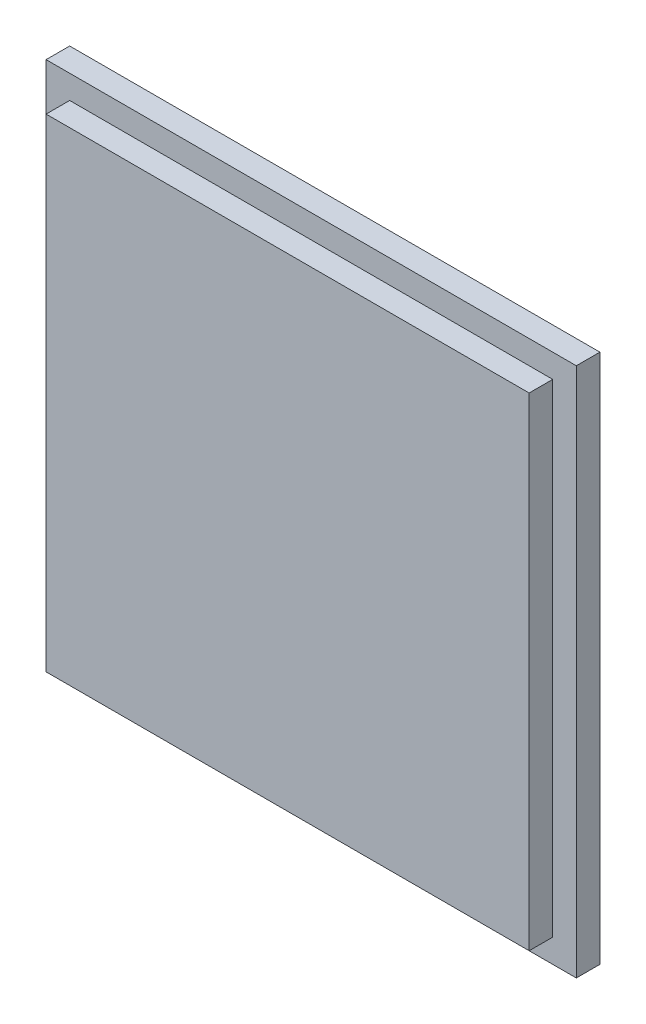
ISO-10303-21;
HEADER;
FILE_DESCRIPTION(('STEP AP214'),'2;1');
FILE_NAME('part.step','',(''),(''),'','','');
FILE_SCHEMA(('AUTOMOTIVE_DESIGN { 1 0 10303 214 1 1 1 1 }'));
ENDSEC;
DATA;
#1=APPLICATION_CONTEXT('core data for automotive mechanical design processes');
#2=APPLICATION_PROTOCOL_DEFINITION('international standard','automotive_design',2000,#1);
#3=PRODUCT_CONTEXT('',#1,'mechanical');
#4=PRODUCT('Part','Part','',(#3));
#5=PRODUCT_RELATED_PRODUCT_CATEGORY('part','',(#4));
#6=PRODUCT_DEFINITION_FORMATION('','',#4);
#7=PRODUCT_DEFINITION_CONTEXT('part definition',#1,'design');
#8=PRODUCT_DEFINITION('design','',#6,#7);
#9=PRODUCT_DEFINITION_SHAPE('','',#8);
#10=(LENGTH_UNIT() NAMED_UNIT(*) SI_UNIT(.MILLI.,.METRE.));
#11=(NAMED_UNIT(*) PLANE_ANGLE_UNIT() SI_UNIT($,.RADIAN.));
#12=(NAMED_UNIT(*) SI_UNIT($,.STERADIAN.) SOLID_ANGLE_UNIT());
#13=UNCERTAINTY_MEASURE_WITH_UNIT(LENGTH_MEASURE(1.E-05),#10,'distance_accuracy_value','');
#14=(GEOMETRIC_REPRESENTATION_CONTEXT(3) GLOBAL_UNCERTAINTY_ASSIGNED_CONTEXT((#13)) GLOBAL_UNIT_ASSIGNED_CONTEXT((#10,
#11,#12)) REPRESENTATION_CONTEXT('',''));
#15=CARTESIAN_POINT('',(0.,0.,0.));
#16=DIRECTION('',(0.,0.,1.));
#17=DIRECTION('',(1.,0.,0.));
#18=AXIS2_PLACEMENT_3D('',#15,#16,#17);
#19=CARTESIAN_POINT('',(0.,0.,2.5));
#20=DIRECTION('',(0.,0.,-1.));
#21=DIRECTION('',(-1.,0.,0.));
#22=AXIS2_PLACEMENT_3D('',#19,#20,#21);
#23=PLANE('',#22);
#24=DIRECTION('',(0.,1.,0.));
#25=VECTOR('',#24,1.);
#26=CARTESIAN_POINT('',(28.1,-28.1,2.5));
#27=LINE('',#26,#25);
#28=CARTESIAN_POINT('',(28.1,-28.1,2.5));
#29=VERTEX_POINT('',#28);
#30=CARTESIAN_POINT('',(28.1,28.1,2.5));
#31=VERTEX_POINT('',#30);
#32=EDGE_CURVE('E139',#29,#31,#27,.T.);
#33=ORIENTED_EDGE('',*,*,#32,.T.);
#34=DIRECTION('',(-1.,0.,0.));
#35=VECTOR('',#34,1.);
#36=CARTESIAN_POINT('',(-28.1,28.1,2.5));
#37=LINE('',#36,#35);
#38=CARTESIAN_POINT('',(-28.1,28.1,2.5));
#39=VERTEX_POINT('',#38);
#40=EDGE_CURVE('E143',#31,#39,#37,.T.);
#41=ORIENTED_EDGE('',*,*,#40,.T.);
#42=DIRECTION('',(0.,-1.,0.));
#43=VECTOR('',#42,1.);
#44=CARTESIAN_POINT('',(-28.1,-28.1,2.5));
#45=LINE('',#44,#43);
#46=CARTESIAN_POINT('',(-28.1,-28.1,2.5));
#47=VERTEX_POINT('',#46);
#48=EDGE_CURVE('E147',#39,#47,#45,.T.);
#49=ORIENTED_EDGE('',*,*,#48,.T.);
#50=DIRECTION('',(1.,0.,0.));
#51=VECTOR('',#50,1.);
#52=CARTESIAN_POINT('',(-28.1,-28.1,2.5));
#53=LINE('',#52,#51);
#54=EDGE_CURVE('E150',#47,#29,#53,.T.);
#55=ORIENTED_EDGE('',*,*,#54,.T.);
#56=EDGE_LOOP('',(#33,#41,#49,#55));
#57=FACE_BOUND('',#56,.T.);
#58=DIRECTION('',(0.,1.,0.));
#59=VECTOR('',#58,1.);
#60=CARTESIAN_POINT('',(25.6,-25.6,2.5));
#61=LINE('',#60,#59);
#62=CARTESIAN_POINT('',(25.6,-25.6,2.5));
#63=VERTEX_POINT('',#62);
#64=CARTESIAN_POINT('',(25.6,25.6,2.5));
#65=VERTEX_POINT('',#64);
#66=EDGE_CURVE('E55',#63,#65,#61,.T.);
#67=ORIENTED_EDGE('',*,*,#66,.F.);
#68=DIRECTION('',(1.,0.,0.));
#69=VECTOR('',#68,1.);
#70=CARTESIAN_POINT('',(-25.6,-25.6,2.5));
#71=LINE('',#70,#69);
#72=CARTESIAN_POINT('',(-25.6,-25.6,2.5));
#73=VERTEX_POINT('',#72);
#74=EDGE_CURVE('E59',#73,#63,#71,.T.);
#75=ORIENTED_EDGE('',*,*,#74,.F.);
#76=DIRECTION('',(0.,-1.,0.));
#77=VECTOR('',#76,1.);
#78=CARTESIAN_POINT('',(-25.6,-25.6,2.5));
#79=LINE('',#78,#77);
#80=CARTESIAN_POINT('',(-25.6,25.6,2.5));
#81=VERTEX_POINT('',#80);
#82=EDGE_CURVE('E283',#81,#73,#79,.T.);
#83=ORIENTED_EDGE('',*,*,#82,.F.);
#84=DIRECTION('',(-1.,0.,0.));
#85=VECTOR('',#84,1.);
#86=CARTESIAN_POINT('',(-25.6,25.6,2.5));
#87=LINE('',#86,#85);
#88=EDGE_CURVE('E293',#65,#81,#87,.T.);
#89=ORIENTED_EDGE('',*,*,#88,.F.);
#90=EDGE_LOOP('',(#67,#75,#83,#89));
#91=FACE_BOUND('',#90,.T.);
#92=ADVANCED_FACE('F39',(#57,#91),#23,.F.);
#93=CARTESIAN_POINT('',(28.1,-28.1,2.5));
#94=DIRECTION('',(-1.,0.,0.));
#95=DIRECTION('',(0.,0.,1.));
#96=AXIS2_PLACEMENT_3D('',#93,#94,#95);
#97=PLANE('',#96);
#98=DIRECTION('',(0.,1.,0.));
#99=VECTOR('',#98,1.);
#100=CARTESIAN_POINT('',(28.1,-28.1,0.));
#101=LINE('',#100,#99);
#102=CARTESIAN_POINT('',(28.1,-28.1,0.));
#103=VERTEX_POINT('',#102);
#104=CARTESIAN_POINT('',(28.1,28.1,0.));
#105=VERTEX_POINT('',#104);
#106=EDGE_CURVE('E128',#103,#105,#101,.T.);
#107=ORIENTED_EDGE('',*,*,#106,.T.);
#108=DIRECTION('',(0.,0.,-1.));
#109=VECTOR('',#108,1.);
#110=CARTESIAN_POINT('',(28.1,28.1,2.5));
#111=LINE('',#110,#109);
#112=EDGE_CURVE('E11',#31,#105,#111,.T.);
#113=ORIENTED_EDGE('',*,*,#112,.F.);
#114=ORIENTED_EDGE('',*,*,#32,.F.);
#115=DIRECTION('',(0.,0.,-1.));
#116=VECTOR('',#115,1.);
#117=CARTESIAN_POINT('',(28.1,-28.1,2.5));
#118=LINE('',#117,#116);
#119=EDGE_CURVE('E152',#29,#103,#118,.T.);
#120=ORIENTED_EDGE('',*,*,#119,.T.);
#121=EDGE_LOOP('',(#107,#113,#114,#120));
#122=FACE_BOUND('',#121,.T.);
#123=ADVANCED_FACE('F41',(#122),#97,.F.);
#124=CARTESIAN_POINT('',(-28.1,28.1,2.5));
#125=DIRECTION('',(0.,-1.,0.));
#126=DIRECTION('',(0.,0.,-1.));
#127=AXIS2_PLACEMENT_3D('',#124,#125,#126);
#128=PLANE('',#127);
#129=DIRECTION('',(-1.,0.,0.));
#130=VECTOR('',#129,1.);
#131=CARTESIAN_POINT('',(-28.1,28.1,0.));
#132=LINE('',#131,#130);
#133=CARTESIAN_POINT('',(-28.1,28.1,0.));
#134=VERTEX_POINT('',#133);
#135=EDGE_CURVE('E133',#105,#134,#132,.T.);
#136=ORIENTED_EDGE('',*,*,#135,.T.);
#137=DIRECTION('',(0.,0.,-1.));
#138=VECTOR('',#137,1.);
#139=CARTESIAN_POINT('',(-28.1,28.1,2.5));
#140=LINE('',#139,#138);
#141=EDGE_CURVE('E48',#39,#134,#140,.T.);
#142=ORIENTED_EDGE('',*,*,#141,.F.);
#143=ORIENTED_EDGE('',*,*,#40,.F.);
#144=ORIENTED_EDGE('',*,*,#112,.T.);
#145=EDGE_LOOP('',(#136,#142,#143,#144));
#146=FACE_BOUND('',#145,.T.);
#147=ADVANCED_FACE('F188',(#146),#128,.F.);
#148=CARTESIAN_POINT('',(-28.1,-28.1,2.5));
#149=DIRECTION('',(1.,0.,0.));
#150=DIRECTION('',(0.,0.,-1.));
#151=AXIS2_PLACEMENT_3D('',#148,#149,#150);
#152=PLANE('',#151);
#153=DIRECTION('',(0.,-1.,0.));
#154=VECTOR('',#153,1.);
#155=CARTESIAN_POINT('',(-28.1,-28.1,0.));
#156=LINE('',#155,#154);
#157=CARTESIAN_POINT('',(-28.1,-28.1,0.));
#158=VERTEX_POINT('',#157);
#159=EDGE_CURVE('E156',#134,#158,#156,.T.);
#160=ORIENTED_EDGE('',*,*,#159,.T.);
#161=DIRECTION('',(0.,0.,-1.));
#162=VECTOR('',#161,1.);
#163=CARTESIAN_POINT('',(-28.1,-28.1,2.5));
#164=LINE('',#163,#162);
#165=EDGE_CURVE('E164',#47,#158,#164,.T.);
#166=ORIENTED_EDGE('',*,*,#165,.F.);
#167=ORIENTED_EDGE('',*,*,#48,.F.);
#168=ORIENTED_EDGE('',*,*,#141,.T.);
#169=EDGE_LOOP('',(#160,#166,#167,#168));
#170=FACE_BOUND('',#169,.T.);
#171=ADVANCED_FACE('F173',(#170),#152,.F.);
#172=CARTESIAN_POINT('',(-28.1,-28.1,2.5));
#173=DIRECTION('',(0.,1.,0.));
#174=DIRECTION('',(-1.,0.,0.));
#175=AXIS2_PLACEMENT_3D('',#172,#173,#174);
#176=PLANE('',#175);
#177=DIRECTION('',(1.,0.,0.));
#178=VECTOR('',#177,1.);
#179=CARTESIAN_POINT('',(-28.1,-28.1,0.));
#180=LINE('',#179,#178);
#181=EDGE_CURVE('E144',#158,#103,#180,.T.);
#182=ORIENTED_EDGE('',*,*,#181,.T.);
#183=ORIENTED_EDGE('',*,*,#119,.F.);
#184=ORIENTED_EDGE('',*,*,#54,.F.);
#185=ORIENTED_EDGE('',*,*,#165,.T.);
#186=EDGE_LOOP('',(#182,#183,#184,#185));
#187=FACE_BOUND('',#186,.T.);
#188=ADVANCED_FACE('F182',(#187),#176,.F.);
#189=CARTESIAN_POINT('',(0.,0.,0.));
#190=DIRECTION('',(0.,0.,-1.));
#191=DIRECTION('',(-1.,0.,0.));
#192=AXIS2_PLACEMENT_3D('',#189,#190,#191);
#193=PLANE('',#192);
#194=ORIENTED_EDGE('',*,*,#106,.F.);
#195=ORIENTED_EDGE('',*,*,#181,.F.);
#196=ORIENTED_EDGE('',*,*,#159,.F.);
#197=ORIENTED_EDGE('',*,*,#135,.F.);
#198=EDGE_LOOP('',(#194,#195,#196,#197));
#199=FACE_BOUND('',#198,.T.);
#200=ADVANCED_FACE('F179',(#199),#193,.T.);
#201=CARTESIAN_POINT('',(25.6,-25.6,5.));
#202=DIRECTION('',(-1.,0.,0.));
#203=DIRECTION('',(0.,0.,1.));
#204=AXIS2_PLACEMENT_3D('',#201,#202,#203);
#205=PLANE('',#204);
#206=ORIENTED_EDGE('',*,*,#66,.T.);
#207=DIRECTION('',(0.,0.,-1.));
#208=VECTOR('',#207,1.);
#209=CARTESIAN_POINT('',(25.6,25.6,5.));
#210=LINE('',#209,#208);
#211=CARTESIAN_POINT('',(25.6,25.6,5.));
#212=VERTEX_POINT('',#211);
#213=EDGE_CURVE('E108',#212,#65,#210,.T.);
#214=ORIENTED_EDGE('',*,*,#213,.F.);
#215=DIRECTION('',(0.,1.,0.));
#216=VECTOR('',#215,1.);
#217=CARTESIAN_POINT('',(25.6,-25.6,5.));
#218=LINE('',#217,#216);
#219=CARTESIAN_POINT('',(25.6,-25.6,5.));
#220=VERTEX_POINT('',#219);
#221=EDGE_CURVE('E115',#220,#212,#218,.T.);
#222=ORIENTED_EDGE('',*,*,#221,.F.);
#223=DIRECTION('',(0.,0.,-1.));
#224=VECTOR('',#223,1.);
#225=CARTESIAN_POINT('',(25.6,-25.6,5.));
#226=LINE('',#225,#224);
#227=EDGE_CURVE('E280',#220,#63,#226,.T.);
#228=ORIENTED_EDGE('',*,*,#227,.T.);
#229=EDGE_LOOP('',(#206,#214,#222,#228));
#230=FACE_BOUND('',#229,.T.);
#231=ADVANCED_FACE('F126',(#230),#205,.F.);
#232=CARTESIAN_POINT('',(-25.6,25.6,5.));
#233=DIRECTION('',(0.,-1.,0.));
#234=DIRECTION('',(0.,0.,-1.));
#235=AXIS2_PLACEMENT_3D('',#232,#233,#234);
#236=PLANE('',#235);
#237=ORIENTED_EDGE('',*,*,#88,.T.);
#238=DIRECTION('',(0.,0.,-1.));
#239=VECTOR('',#238,1.);
#240=CARTESIAN_POINT('',(-25.6,25.6,5.));
#241=LINE('',#240,#239);
#242=CARTESIAN_POINT('',(-25.6,25.6,5.));
#243=VERTEX_POINT('',#242);
#244=EDGE_CURVE('E110',#243,#81,#241,.T.);
#245=ORIENTED_EDGE('',*,*,#244,.F.);
#246=DIRECTION('',(-1.,0.,0.));
#247=VECTOR('',#246,1.);
#248=CARTESIAN_POINT('',(-25.6,25.6,5.));
#249=LINE('',#248,#247);
#250=EDGE_CURVE('E103',#212,#243,#249,.T.);
#251=ORIENTED_EDGE('',*,*,#250,.F.);
#252=ORIENTED_EDGE('',*,*,#213,.T.);
#253=EDGE_LOOP('',(#237,#245,#251,#252));
#254=FACE_BOUND('',#253,.T.);
#255=ADVANCED_FACE('F106',(#254),#236,.F.);
#256=CARTESIAN_POINT('',(-25.6,-25.6,5.));
#257=DIRECTION('',(1.,0.,0.));
#258=DIRECTION('',(0.,0.,-1.));
#259=AXIS2_PLACEMENT_3D('',#256,#257,#258);
#260=PLANE('',#259);
#261=ORIENTED_EDGE('',*,*,#82,.T.);
#262=DIRECTION('',(0.,0.,-1.));
#263=VECTOR('',#262,1.);
#264=CARTESIAN_POINT('',(-25.6,-25.6,5.));
#265=LINE('',#264,#263);
#266=CARTESIAN_POINT('',(-25.6,-25.6,5.));
#267=VERTEX_POINT('',#266);
#268=EDGE_CURVE('E135',#267,#73,#265,.T.);
#269=ORIENTED_EDGE('',*,*,#268,.F.);
#270=DIRECTION('',(0.,-1.,0.));
#271=VECTOR('',#270,1.);
#272=CARTESIAN_POINT('',(-25.6,-25.6,5.));
#273=LINE('',#272,#271);
#274=EDGE_CURVE('E114',#243,#267,#273,.T.);
#275=ORIENTED_EDGE('',*,*,#274,.F.);
#276=ORIENTED_EDGE('',*,*,#244,.T.);
#277=EDGE_LOOP('',(#261,#269,#275,#276));
#278=FACE_BOUND('',#277,.T.);
#279=ADVANCED_FACE('F224',(#278),#260,.F.);
#280=CARTESIAN_POINT('',(-25.6,-25.6,5.));
#281=DIRECTION('',(0.,1.,0.));
#282=DIRECTION('',(0.,0.,1.));
#283=AXIS2_PLACEMENT_3D('',#280,#281,#282);
#284=PLANE('',#283);
#285=ORIENTED_EDGE('',*,*,#74,.T.);
#286=ORIENTED_EDGE('',*,*,#227,.F.);
#287=DIRECTION('',(1.,0.,0.));
#288=VECTOR('',#287,1.);
#289=CARTESIAN_POINT('',(-25.6,-25.6,5.));
#290=LINE('',#289,#288);
#291=EDGE_CURVE('E120',#267,#220,#290,.T.);
#292=ORIENTED_EDGE('',*,*,#291,.F.);
#293=ORIENTED_EDGE('',*,*,#268,.T.);
#294=EDGE_LOOP('',(#285,#286,#292,#293));
#295=FACE_BOUND('',#294,.T.);
#296=ADVANCED_FACE('F230',(#295),#284,.F.);
#297=CARTESIAN_POINT('',(0.,0.,5.));
#298=DIRECTION('',(0.,0.,-1.));
#299=DIRECTION('',(-1.,0.,0.));
#300=AXIS2_PLACEMENT_3D('',#297,#298,#299);
#301=PLANE('',#300);
#302=ORIENTED_EDGE('',*,*,#221,.T.);
#303=ORIENTED_EDGE('',*,*,#250,.T.);
#304=ORIENTED_EDGE('',*,*,#274,.T.);
#305=ORIENTED_EDGE('',*,*,#291,.T.);
#306=EDGE_LOOP('',(#302,#303,#304,#305));
#307=FACE_BOUND('',#306,.T.);
#308=ADVANCED_FACE('F118',(#307),#301,.F.);
#309=CLOSED_SHELL('',(#92,#123,#147,#171,#188,#200,#231,#255,#279,#296,#308));
#310=MANIFOLD_SOLID_BREP('B2',#309);
#311=ADVANCED_BREP_SHAPE_REPRESENTATION('',(#18,#310),#14);
#312=SHAPE_DEFINITION_REPRESENTATION(#9,#311);
ENDSEC;
END-ISO-10303-21;
